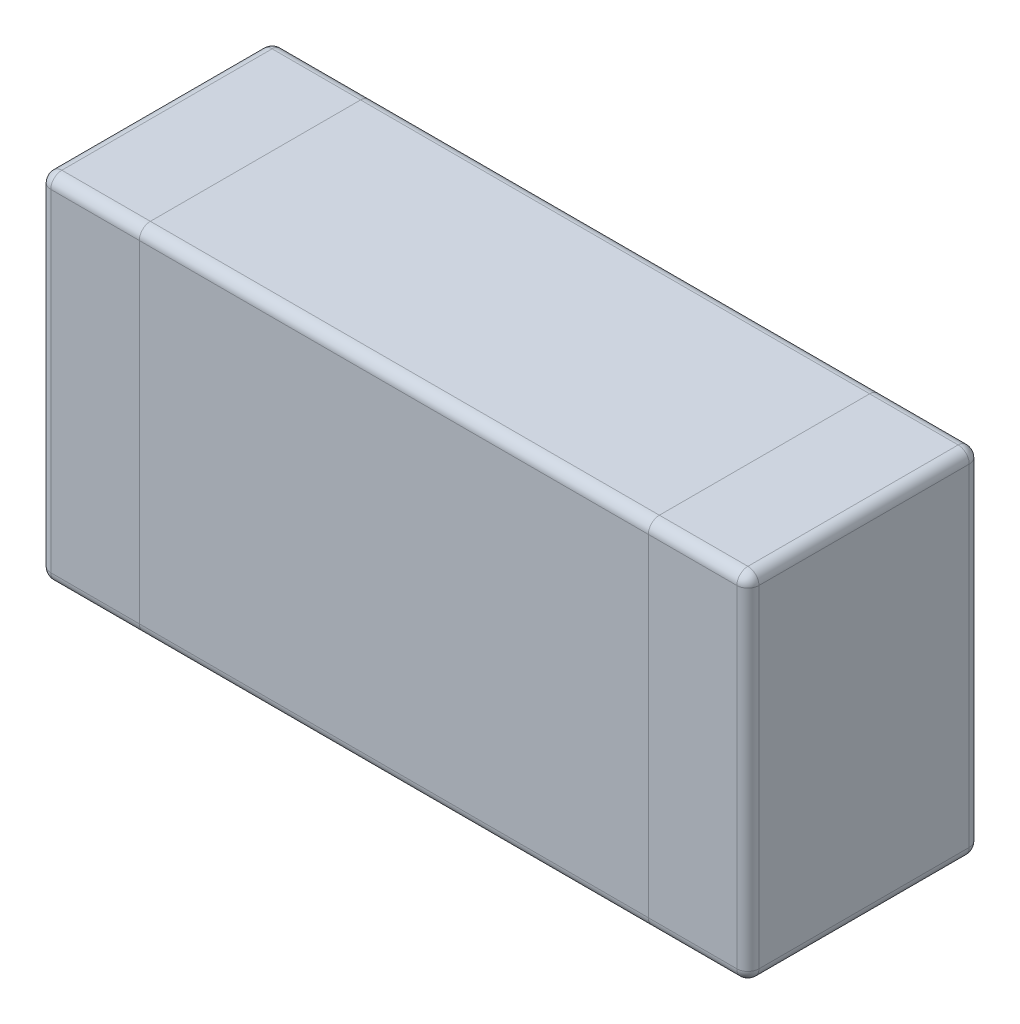
ISO-10303-21;
HEADER;
FILE_DESCRIPTION(('STEP AP214'),'2;1');
FILE_NAME('part.step','',(''),(''),'','','');
FILE_SCHEMA(('AUTOMOTIVE_DESIGN { 1 0 10303 214 1 1 1 1 }'));
ENDSEC;
DATA;
#1=APPLICATION_CONTEXT('core data for automotive mechanical design processes');
#2=APPLICATION_PROTOCOL_DEFINITION('international standard','automotive_design',2000,#1);
#3=PRODUCT_CONTEXT('',#1,'mechanical');
#4=PRODUCT('Part','Part','',(#3));
#5=PRODUCT_RELATED_PRODUCT_CATEGORY('part','',(#4));
#6=PRODUCT_DEFINITION_FORMATION('','',#4);
#7=PRODUCT_DEFINITION_CONTEXT('part definition',#1,'design');
#8=PRODUCT_DEFINITION('design','',#6,#7);
#9=PRODUCT_DEFINITION_SHAPE('','',#8);
#10=(LENGTH_UNIT() NAMED_UNIT(*) SI_UNIT(.MILLI.,.METRE.));
#11=(NAMED_UNIT(*) PLANE_ANGLE_UNIT() SI_UNIT($,.RADIAN.));
#12=(NAMED_UNIT(*) SI_UNIT($,.STERADIAN.) SOLID_ANGLE_UNIT());
#13=UNCERTAINTY_MEASURE_WITH_UNIT(LENGTH_MEASURE(1.E-05),#10,'distance_accuracy_value','');
#14=(GEOMETRIC_REPRESENTATION_CONTEXT(3) GLOBAL_UNCERTAINTY_ASSIGNED_CONTEXT((#13)) GLOBAL_UNIT_ASSIGNED_CONTEXT((#10,
#11,#12)) REPRESENTATION_CONTEXT('',''));
#15=CARTESIAN_POINT('',(0.,0.,0.));
#16=DIRECTION('',(0.,0.,1.));
#17=DIRECTION('',(1.,0.,0.));
#18=AXIS2_PLACEMENT_3D('',#15,#16,#17);
#19=CARTESIAN_POINT('',(1.55,0.749999999999718,1.0500000000002));
#20=DIRECTION('',(0.,2.68882138776405E-13,-1.));
#21=DIRECTION('',(0.,1.,2.68882138776405E-13));
#22=AXIS2_PLACEMENT_3D('',#19,#20,#21);
#23=CYLINDRICAL_SURFACE('',#22,0.05);
#24=CARTESIAN_POINT('',(1.55,0.749999999999731,1.0000000000002));
#25=DIRECTION('',(0.,2.68882138776405E-13,-1.));
#26=DIRECTION('',(0.,-1.,-2.68882138776405E-13));
#27=AXIS2_PLACEMENT_3D('',#24,#25,#26);
#28=CIRCLE('',#27,0.05);
#29=CARTESIAN_POINT('',(1.55,0.799999999999731,1.00000000000021));
#30=VERTEX_POINT('',#29);
#31=CARTESIAN_POINT('',(1.6,0.749999999999731,1.0000000000002));
#32=VERTEX_POINT('',#31);
#33=EDGE_CURVE('E25',#30,#32,#28,.T.);
#34=ORIENTED_EDGE('',*,*,#33,.T.);
#35=DIRECTION('',(0.,-2.68736422004423E-13,1.));
#36=VECTOR('',#35,1.);
#37=CARTESIAN_POINT('',(1.6,0.749999999999718,1.0500000000002));
#38=LINE('',#37,#36);
#39=CARTESIAN_POINT('',(1.6,0.749999999999987,0.0500000000002015));
#40=VERTEX_POINT('',#39);
#41=EDGE_CURVE('E426',#40,#32,#38,.T.);
#42=ORIENTED_EDGE('',*,*,#41,.F.);
#43=CARTESIAN_POINT('',(1.55,0.749999999999987,0.0500000000002015));
#44=DIRECTION('',(0.,-2.68746613504845E-13,1.));
#45=DIRECTION('',(0.,1.,2.68746613504845E-13));
#46=AXIS2_PLACEMENT_3D('',#43,#44,#45);
#47=CIRCLE('',#46,0.05);
#48=CARTESIAN_POINT('',(1.55,0.799999999999987,0.0500000000002149));
#49=VERTEX_POINT('',#48);
#50=EDGE_CURVE('E11',#40,#49,#47,.T.);
#51=ORIENTED_EDGE('',*,*,#50,.T.);
#52=DIRECTION('',(0.,2.68736422004423E-13,-1.));
#53=VECTOR('',#52,1.);
#54=CARTESIAN_POINT('',(1.55,0.799999999999718,1.05000000000021));
#55=LINE('',#54,#53);
#56=EDGE_CURVE('E436',#30,#49,#55,.T.);
#57=ORIENTED_EDGE('',*,*,#56,.F.);
#58=EDGE_LOOP('',(#34,#42,#51,#57));
#59=FACE_BOUND('',#58,.T.);
#60=ADVANCED_FACE('F17',(#59),#23,.T.);
#61=CARTESIAN_POINT('',(1.55,0.749999999999987,0.0500000000002016));
#62=DIRECTION('',(0.,-2.68736422004423E-13,1.));
#63=DIRECTION('',(1.,0.,0.));
#64=AXIS2_PLACEMENT_3D('',#61,#62,#63);
#65=SPHERICAL_SURFACE('',#64,0.05);
#66=CARTESIAN_POINT('',(1.55,0.749999999999987,0.0500000000002015));
#67=DIRECTION('',(0.,1.,2.68736422004423E-13));
#68=DIRECTION('',(-1.,0.,0.));
#69=AXIS2_PLACEMENT_3D('',#66,#67,#68);
#70=CIRCLE('',#69,0.05);
#71=CARTESIAN_POINT('',(1.55,0.75,2.01552316503317E-13));
#72=VERTEX_POINT('',#71);
#73=EDGE_CURVE('E403',#40,#72,#70,.T.);
#74=ORIENTED_EDGE('',*,*,#73,.T.);
#75=CARTESIAN_POINT('',(1.55,0.749999999999987,0.0500000000002016));
#76=DIRECTION('',(1.,0.,0.));
#77=DIRECTION('',(0.,1.,2.68746613504845E-13));
#78=AXIS2_PLACEMENT_3D('',#75,#76,#77);
#79=CIRCLE('',#78,0.05);
#80=EDGE_CURVE('E268',#72,#49,#79,.T.);
#81=ORIENTED_EDGE('',*,*,#80,.T.);
#82=ORIENTED_EDGE('',*,*,#50,.F.);
#83=EDGE_LOOP('',(#74,#81,#82));
#84=FACE_BOUND('',#83,.T.);
#85=ADVANCED_FACE('F555',(#84),#65,.T.);
#86=CARTESIAN_POINT('',(1.55,0.749999999999731,1.0000000000002));
#87=DIRECTION('',(0.,-2.68736422004423E-13,1.));
#88=DIRECTION('',(1.,0.,0.));
#89=AXIS2_PLACEMENT_3D('',#86,#87,#88);
#90=SPHERICAL_SURFACE('',#89,0.05);
#91=CARTESIAN_POINT('',(1.55,0.749999999999731,1.0000000000002));
#92=DIRECTION('',(1.,0.,0.));
#93=DIRECTION('',(0.,-2.68882138776406E-13,1.));
#94=AXIS2_PLACEMENT_3D('',#91,#92,#93);
#95=CIRCLE('',#94,0.05);
#96=CARTESIAN_POINT('',(1.55,0.749999999999718,1.0500000000002));
#97=VERTEX_POINT('',#96);
#98=EDGE_CURVE('E293',#30,#97,#95,.T.);
#99=ORIENTED_EDGE('',*,*,#98,.T.);
#100=CARTESIAN_POINT('',(1.55,0.749999999999731,1.0000000000002));
#101=DIRECTION('',(0.,1.,2.68736422004423E-13));
#102=DIRECTION('',(-1.,0.,0.));
#103=AXIS2_PLACEMENT_3D('',#100,#101,#102);
#104=CIRCLE('',#103,0.05);
#105=EDGE_CURVE('E405',#97,#32,#104,.T.);
#106=ORIENTED_EDGE('',*,*,#105,.T.);
#107=ORIENTED_EDGE('',*,*,#33,.F.);
#108=EDGE_LOOP('',(#99,#106,#107));
#109=FACE_BOUND('',#108,.T.);
#110=ADVANCED_FACE('F512',(#109),#90,.T.);
#111=CARTESIAN_POINT('',(1.55,-0.800000000000014,0.0499999999997849));
#112=DIRECTION('',(0.,-1.,-2.68736422004423E-13));
#113=DIRECTION('',(1.,0.,0.));
#114=AXIS2_PLACEMENT_3D('',#111,#112,#113);
#115=CYLINDRICAL_SURFACE('',#114,0.05);
#116=CARTESIAN_POINT('',(1.55,-0.750000000000014,0.0499999999997985));
#117=DIRECTION('',(0.,1.,2.68736422004423E-13));
#118=DIRECTION('',(1.,0.,0.));
#119=AXIS2_PLACEMENT_3D('',#116,#117,#118);
#120=CIRCLE('',#119,0.05);
#121=CARTESIAN_POINT('',(1.6,-0.750000000000014,0.0499999999997984));
#122=VERTEX_POINT('',#121);
#123=CARTESIAN_POINT('',(1.55,-0.75,-2.01552316503317E-13));
#124=VERTEX_POINT('',#123);
#125=EDGE_CURVE('E504',#122,#124,#120,.T.);
#126=ORIENTED_EDGE('',*,*,#125,.T.);
#127=DIRECTION('',(0.,-1.,-2.68736422004423E-13));
#128=VECTOR('',#127,1.);
#129=CARTESIAN_POINT('',(1.55,-0.8,-2.14989137603538E-13));
#130=LINE('',#129,#128);
#131=EDGE_CURVE('E226',#72,#124,#130,.T.);
#132=ORIENTED_EDGE('',*,*,#131,.F.);
#133=ORIENTED_EDGE('',*,*,#73,.F.);
#134=DIRECTION('',(0.,1.,2.68736422004423E-13));
#135=VECTOR('',#134,1.);
#136=CARTESIAN_POINT('',(1.6,0.799999999999987,0.0500000000002149));
#137=LINE('',#136,#135);
#138=EDGE_CURVE('E432',#122,#40,#137,.T.);
#139=ORIENTED_EDGE('',*,*,#138,.F.);
#140=EDGE_LOOP('',(#126,#132,#133,#139));
#141=FACE_BOUND('',#140,.T.);
#142=ADVANCED_FACE('F551',(#141),#115,.T.);
#143=CARTESIAN_POINT('',(-1.6,0.749999999999987,0.0500000000002015));
#144=DIRECTION('',(1.,0.,0.));
#145=DIRECTION('',(0.,1.,2.68746613504845E-13));
#146=AXIS2_PLACEMENT_3D('',#143,#144,#145);
#147=CYLINDRICAL_SURFACE('',#146,0.05);
#148=CARTESIAN_POINT('',(-1.15,0.749999999999987,0.0500000000002015));
#149=DIRECTION('',(-1.,0.,0.));
#150=DIRECTION('',(0.,1.,2.68746613504845E-13));
#151=AXIS2_PLACEMENT_3D('',#148,#149,#150);
#152=CIRCLE('',#151,0.05);
#153=CARTESIAN_POINT('',(-1.15,0.799999999999987,0.0500000000002149));
#154=VERTEX_POINT('',#153);
#155=CARTESIAN_POINT('',(-1.15,0.75,2.01552316503317E-13));
#156=VERTEX_POINT('',#155);
#157=EDGE_CURVE('E316',#154,#156,#152,.T.);
#158=ORIENTED_EDGE('',*,*,#157,.F.);
#159=DIRECTION('',(-1.,0.,0.));
#160=VECTOR('',#159,1.);
#161=CARTESIAN_POINT('',(-1.6,0.799999999999987,0.0500000000002149));
#162=LINE('',#161,#160);
#163=CARTESIAN_POINT('',(1.15,0.799999999999987,0.0500000000002149));
#164=VERTEX_POINT('',#163);
#165=EDGE_CURVE('E429',#164,#154,#162,.T.);
#166=ORIENTED_EDGE('',*,*,#165,.F.);
#167=CARTESIAN_POINT('',(1.15,0.749999999999987,0.0500000000002015));
#168=DIRECTION('',(1.,0.,0.));
#169=DIRECTION('',(0.,-1.,-2.68746613504845E-13));
#170=AXIS2_PLACEMENT_3D('',#167,#168,#169);
#171=CIRCLE('',#170,0.05);
#172=CARTESIAN_POINT('',(1.15,0.75,2.01552316503317E-13));
#173=VERTEX_POINT('',#172);
#174=EDGE_CURVE('E342',#173,#164,#171,.T.);
#175=ORIENTED_EDGE('',*,*,#174,.F.);
#176=DIRECTION('',(1.,0.,0.));
#177=VECTOR('',#176,1.);
#178=CARTESIAN_POINT('',(1.6,0.75,2.01552316503317E-13));
#179=LINE('',#178,#177);
#180=EDGE_CURVE('E477',#156,#173,#179,.T.);
#181=ORIENTED_EDGE('',*,*,#180,.F.);
#182=EDGE_LOOP('',(#158,#166,#175,#181));
#183=FACE_BOUND('',#182,.T.);
#184=ADVANCED_FACE('F562',(#183),#147,.T.);
#185=CARTESIAN_POINT('',(1.6,0.749999999999731,1.0000000000002));
#186=DIRECTION('',(-1.,0.,0.));
#187=DIRECTION('',(0.,-1.,-2.68882138776405E-13));
#188=AXIS2_PLACEMENT_3D('',#185,#186,#187);
#189=CYLINDRICAL_SURFACE('',#188,0.05);
#190=CARTESIAN_POINT('',(-1.15,0.749999999999731,1.0000000000002));
#191=DIRECTION('',(-1.,0.,0.));
#192=DIRECTION('',(0.,1.,2.68882138776405E-13));
#193=AXIS2_PLACEMENT_3D('',#190,#191,#192);
#194=CIRCLE('',#193,0.05);
#195=CARTESIAN_POINT('',(-1.15,0.749999999999718,1.0500000000002));
#196=VERTEX_POINT('',#195);
#197=CARTESIAN_POINT('',(-1.15,0.799999999999731,1.00000000000021));
#198=VERTEX_POINT('',#197);
#199=EDGE_CURVE('E217',#196,#198,#194,.T.);
#200=ORIENTED_EDGE('',*,*,#199,.F.);
#201=DIRECTION('',(-1.,0.,0.));
#202=VECTOR('',#201,1.);
#203=CARTESIAN_POINT('',(1.6,0.749999999999718,1.0500000000002));
#204=LINE('',#203,#202);
#205=CARTESIAN_POINT('',(1.15,0.749999999999718,1.0500000000002));
#206=VERTEX_POINT('',#205);
#207=EDGE_CURVE('E202',#206,#196,#204,.T.);
#208=ORIENTED_EDGE('',*,*,#207,.F.);
#209=CARTESIAN_POINT('',(1.15,0.749999999999731,1.0000000000002));
#210=DIRECTION('',(1.,0.,0.));
#211=DIRECTION('',(0.,-1.,-2.68882138776405E-13));
#212=AXIS2_PLACEMENT_3D('',#209,#210,#211);
#213=CIRCLE('',#212,0.05);
#214=CARTESIAN_POINT('',(1.15,0.799999999999731,1.00000000000021));
#215=VERTEX_POINT('',#214);
#216=EDGE_CURVE('E298',#215,#206,#213,.T.);
#217=ORIENTED_EDGE('',*,*,#216,.F.);
#218=DIRECTION('',(1.,0.,0.));
#219=VECTOR('',#218,1.);
#220=CARTESIAN_POINT('',(-1.6,0.799999999999731,1.00000000000021));
#221=LINE('',#220,#219);
#222=EDGE_CURVE('E220',#198,#215,#221,.T.);
#223=ORIENTED_EDGE('',*,*,#222,.F.);
#224=EDGE_LOOP('',(#200,#208,#217,#223));
#225=FACE_BOUND('',#224,.T.);
#226=ADVANCED_FACE('F219',(#225),#189,.T.);
#227=CARTESIAN_POINT('',(1.55,0.799999999999731,1.00000000000021));
#228=DIRECTION('',(0.,1.,2.68736422004423E-13));
#229=DIRECTION('',(-1.,0.,0.));
#230=AXIS2_PLACEMENT_3D('',#227,#228,#229);
#231=CYLINDRICAL_SURFACE('',#230,0.05);
#232=CARTESIAN_POINT('',(1.55,-0.750000000000269,0.999999999999799));
#233=DIRECTION('',(0.,1.,2.71050543121376E-13));
#234=DIRECTION('',(0.,2.71050543121376E-13,-1.));
#235=AXIS2_PLACEMENT_3D('',#232,#233,#234);
#236=CIRCLE('',#235,0.05);
#237=CARTESIAN_POINT('',(1.55,-0.750000000000283,1.0499999999998));
#238=VERTEX_POINT('',#237);
#239=CARTESIAN_POINT('',(1.6,-0.750000000000269,0.999999999999799));
#240=VERTEX_POINT('',#239);
#241=EDGE_CURVE('E501',#238,#240,#236,.T.);
#242=ORIENTED_EDGE('',*,*,#241,.T.);
#243=DIRECTION('',(0.,-1.,-2.68736422004423E-13));
#244=VECTOR('',#243,1.);
#245=CARTESIAN_POINT('',(1.6,-0.800000000000269,0.999999999999786));
#246=LINE('',#245,#244);
#247=EDGE_CURVE('E421',#32,#240,#246,.T.);
#248=ORIENTED_EDGE('',*,*,#247,.F.);
#249=ORIENTED_EDGE('',*,*,#105,.F.);
#250=DIRECTION('',(0.,1.,2.68736422004423E-13));
#251=VECTOR('',#250,1.);
#252=CARTESIAN_POINT('',(1.55,0.799999999999718,1.05000000000021));
#253=LINE('',#252,#251);
#254=EDGE_CURVE('E277',#238,#97,#253,.T.);
#255=ORIENTED_EDGE('',*,*,#254,.F.);
#256=EDGE_LOOP('',(#242,#248,#249,#255));
#257=FACE_BOUND('',#256,.T.);
#258=ADVANCED_FACE('F518',(#257),#231,.T.);
#259=CARTESIAN_POINT('',(1.55,-0.750000000000014,0.0499999999997985));
#260=DIRECTION('',(0.,-2.68736422004423E-13,1.));
#261=DIRECTION('',(1.,0.,0.));
#262=AXIS2_PLACEMENT_3D('',#259,#260,#261);
#263=SPHERICAL_SURFACE('',#262,0.05);
#264=CARTESIAN_POINT('',(1.55,-0.750000000000014,0.0499999999997984));
#265=DIRECTION('',(0.,2.68746613504845E-13,-1.));
#266=DIRECTION('',(0.,1.,2.68746613504845E-13));
#267=AXIS2_PLACEMENT_3D('',#264,#265,#266);
#268=CIRCLE('',#267,0.05);
#269=CARTESIAN_POINT('',(1.55,-0.800000000000014,0.0499999999997849));
#270=VERTEX_POINT('',#269);
#271=EDGE_CURVE('E292',#122,#270,#268,.T.);
#272=ORIENTED_EDGE('',*,*,#271,.T.);
#273=CARTESIAN_POINT('',(1.55,-0.750000000000014,0.0499999999997984));
#274=DIRECTION('',(1.,0.,0.));
#275=DIRECTION('',(0.,1.,2.68746613504845E-13));
#276=AXIS2_PLACEMENT_3D('',#273,#274,#275);
#277=CIRCLE('',#276,0.05);
#278=EDGE_CURVE('E370',#270,#124,#277,.T.);
#279=ORIENTED_EDGE('',*,*,#278,.T.);
#280=ORIENTED_EDGE('',*,*,#125,.F.);
#281=EDGE_LOOP('',(#272,#279,#280));
#282=FACE_BOUND('',#281,.T.);
#283=ADVANCED_FACE('F1326',(#282),#263,.T.);
#284=CARTESIAN_POINT('',(-1.55,0.749999999999987,0.0500000000002016));
#285=DIRECTION('',(0.,-2.68736422004423E-13,1.));
#286=DIRECTION('',(1.,0.,0.));
#287=AXIS2_PLACEMENT_3D('',#284,#285,#286);
#288=SPHERICAL_SURFACE('',#287,0.05);
#289=CARTESIAN_POINT('',(-1.55,0.749999999999987,0.0500000000002016));
#290=DIRECTION('',(0.,1.,2.68736422004423E-13));
#291=DIRECTION('',(-1.,0.,0.));
#292=AXIS2_PLACEMENT_3D('',#289,#290,#291);
#293=CIRCLE('',#292,0.05);
#294=CARTESIAN_POINT('',(-1.55,0.75,2.01552316503317E-13));
#295=VERTEX_POINT('',#294);
#296=CARTESIAN_POINT('',(-1.6,0.749999999999987,0.0500000000002015));
#297=VERTEX_POINT('',#296);
#298=EDGE_CURVE('E38',#295,#297,#293,.T.);
#299=ORIENTED_EDGE('',*,*,#298,.T.);
#300=CARTESIAN_POINT('',(-1.55,0.749999999999987,0.0500000000002015));
#301=DIRECTION('',(0.,2.68746613504845E-13,-1.));
#302=DIRECTION('',(0.,1.,2.68746613504845E-13));
#303=AXIS2_PLACEMENT_3D('',#300,#301,#302);
#304=CIRCLE('',#303,0.05);
#305=CARTESIAN_POINT('',(-1.55,0.799999999999987,0.0500000000002149));
#306=VERTEX_POINT('',#305);
#307=EDGE_CURVE('E480',#297,#306,#304,.T.);
#308=ORIENTED_EDGE('',*,*,#307,.T.);
#309=CARTESIAN_POINT('',(-1.55,0.749999999999987,0.0500000000002015));
#310=DIRECTION('',(1.,0.,0.));
#311=DIRECTION('',(0.,-1.,-2.68746613504845E-13));
#312=AXIS2_PLACEMENT_3D('',#309,#310,#311);
#313=CIRCLE('',#312,0.05);
#314=EDGE_CURVE('E320',#295,#306,#313,.T.);
#315=ORIENTED_EDGE('',*,*,#314,.F.);
#316=EDGE_LOOP('',(#299,#308,#315));
#317=FACE_BOUND('',#316,.T.);
#318=ADVANCED_FACE('F1140',(#317),#288,.T.);
#319=CARTESIAN_POINT('',(-1.55,0.749999999999731,1.0000000000002));
#320=DIRECTION('',(0.,-2.68736422004423E-13,1.));
#321=DIRECTION('',(1.,0.,0.));
#322=AXIS2_PLACEMENT_3D('',#319,#320,#321);
#323=SPHERICAL_SURFACE('',#322,0.05);
#324=CARTESIAN_POINT('',(-1.55,0.749999999999731,1.0000000000002));
#325=DIRECTION('',(0.,-2.68882138776405E-13,1.));
#326=DIRECTION('',(0.,-1.,-2.68882138776405E-13));
#327=AXIS2_PLACEMENT_3D('',#324,#325,#326);
#328=CIRCLE('',#327,0.05);
#329=CARTESIAN_POINT('',(-1.55,0.799999999999731,1.00000000000021));
#330=VERTEX_POINT('',#329);
#331=CARTESIAN_POINT('',(-1.6,0.749999999999732,1.0000000000002));
#332=VERTEX_POINT('',#331);
#333=EDGE_CURVE('E49',#330,#332,#328,.T.);
#334=ORIENTED_EDGE('',*,*,#333,.T.);
#335=CARTESIAN_POINT('',(-1.55,0.749999999999732,1.0000000000002));
#336=DIRECTION('',(0.,1.,2.71050543121376E-13));
#337=DIRECTION('',(0.,-2.71050543121376E-13,1.));
#338=AXIS2_PLACEMENT_3D('',#335,#336,#337);
#339=CIRCLE('',#338,0.05);
#340=CARTESIAN_POINT('',(-1.55,0.749999999999718,1.0500000000002));
#341=VERTEX_POINT('',#340);
#342=EDGE_CURVE('E459',#332,#341,#339,.T.);
#343=ORIENTED_EDGE('',*,*,#342,.T.);
#344=CARTESIAN_POINT('',(-1.55,0.749999999999731,1.0000000000002));
#345=DIRECTION('',(1.,0.,0.));
#346=DIRECTION('',(0.,-1.,-2.68882138776405E-13));
#347=AXIS2_PLACEMENT_3D('',#344,#345,#346);
#348=CIRCLE('',#347,0.05);
#349=EDGE_CURVE('E232',#330,#341,#348,.T.);
#350=ORIENTED_EDGE('',*,*,#349,.F.);
#351=EDGE_LOOP('',(#334,#343,#350));
#352=FACE_BOUND('',#351,.T.);
#353=ADVANCED_FACE('F570',(#352),#323,.T.);
#354=CARTESIAN_POINT('',(1.55,-0.750000000000269,0.999999999999799));
#355=DIRECTION('',(0.,-2.68736422004423E-13,1.));
#356=DIRECTION('',(1.,0.,0.));
#357=AXIS2_PLACEMENT_3D('',#354,#355,#356);
#358=SPHERICAL_SURFACE('',#357,0.05);
#359=CARTESIAN_POINT('',(1.55,-0.750000000000269,0.999999999999799));
#360=DIRECTION('',(1.,0.,0.));
#361=DIRECTION('',(0.,1.,2.68882138776405E-13));
#362=AXIS2_PLACEMENT_3D('',#359,#360,#361);
#363=CIRCLE('',#362,0.05);
#364=CARTESIAN_POINT('',(1.55,-0.800000000000269,0.999999999999786));
#365=VERTEX_POINT('',#364);
#366=EDGE_CURVE('E309',#238,#365,#363,.T.);
#367=ORIENTED_EDGE('',*,*,#366,.T.);
#368=CARTESIAN_POINT('',(1.55,-0.750000000000269,0.999999999999799));
#369=DIRECTION('',(0.,-2.68882138776405E-13,1.));
#370=DIRECTION('',(0.,-1.,-2.68882138776405E-13));
#371=AXIS2_PLACEMENT_3D('',#368,#369,#370);
#372=CIRCLE('',#371,0.05);
#373=EDGE_CURVE('E288',#365,#240,#372,.T.);
#374=ORIENTED_EDGE('',*,*,#373,.T.);
#375=ORIENTED_EDGE('',*,*,#241,.F.);
#376=EDGE_LOOP('',(#367,#374,#375));
#377=FACE_BOUND('',#376,.T.);
#378=ADVANCED_FACE('F541',(#377),#358,.T.);
#379=CARTESIAN_POINT('',(1.55,-0.750000000000283,1.0499999999998));
#380=DIRECTION('',(0.,2.68882138776405E-13,-1.));
#381=DIRECTION('',(0.,1.,2.68882138776405E-13));
#382=AXIS2_PLACEMENT_3D('',#379,#380,#381);
#383=CYLINDRICAL_SURFACE('',#382,0.05);
#384=ORIENTED_EDGE('',*,*,#373,.F.);
#385=DIRECTION('',(0.,-2.68736422004423E-13,1.));
#386=VECTOR('',#385,1.);
#387=CARTESIAN_POINT('',(1.55,-0.800000000000282,1.04999999999979));
#388=LINE('',#387,#386);
#389=EDGE_CURVE('E346',#270,#365,#388,.T.);
#390=ORIENTED_EDGE('',*,*,#389,.F.);
#391=ORIENTED_EDGE('',*,*,#271,.F.);
#392=DIRECTION('',(0.,2.68736422004423E-13,-1.));
#393=VECTOR('',#392,1.);
#394=CARTESIAN_POINT('',(1.6,-0.750000000000283,1.0499999999998));
#395=LINE('',#394,#393);
#396=EDGE_CURVE('E425',#240,#122,#395,.T.);
#397=ORIENTED_EDGE('',*,*,#396,.F.);
#398=EDGE_LOOP('',(#384,#390,#391,#397));
#399=FACE_BOUND('',#398,.T.);
#400=ADVANCED_FACE('F546',(#399),#383,.T.);
#401=CARTESIAN_POINT('',(-1.6,-0.750000000000014,0.0499999999997984));
#402=DIRECTION('',(-1.,0.,0.));
#403=DIRECTION('',(0.,-1.,-2.68746613504845E-13));
#404=AXIS2_PLACEMENT_3D('',#401,#402,#403);
#405=CYLINDRICAL_SURFACE('',#404,0.05);
#406=CARTESIAN_POINT('',(-1.15,-0.750000000000014,0.0499999999997984));
#407=DIRECTION('',(-1.,0.,0.));
#408=DIRECTION('',(0.,1.,2.68746613504845E-13));
#409=AXIS2_PLACEMENT_3D('',#406,#407,#408);
#410=CIRCLE('',#409,0.05);
#411=CARTESIAN_POINT('',(-1.15,-0.75,-2.01552316503317E-13));
#412=VERTEX_POINT('',#411);
#413=CARTESIAN_POINT('',(-1.15,-0.800000000000014,0.0499999999997849));
#414=VERTEX_POINT('',#413);
#415=EDGE_CURVE('E354',#412,#414,#410,.T.);
#416=ORIENTED_EDGE('',*,*,#415,.F.);
#417=DIRECTION('',(-1.,0.,0.));
#418=VECTOR('',#417,1.);
#419=CARTESIAN_POINT('',(-1.6,-0.75,-2.01552316503317E-13));
#420=LINE('',#419,#418);
#421=CARTESIAN_POINT('',(1.15,-0.75,-2.01552316503317E-13));
#422=VERTEX_POINT('',#421);
#423=EDGE_CURVE('E483',#422,#412,#420,.T.);
#424=ORIENTED_EDGE('',*,*,#423,.F.);
#425=CARTESIAN_POINT('',(1.15,-0.750000000000014,0.0499999999997984));
#426=DIRECTION('',(1.,0.,0.));
#427=DIRECTION('',(0.,-1.,-2.68746613504845E-13));
#428=AXIS2_PLACEMENT_3D('',#425,#426,#427);
#429=CIRCLE('',#428,0.05);
#430=CARTESIAN_POINT('',(1.15,-0.800000000000014,0.0499999999997849));
#431=VERTEX_POINT('',#430);
#432=EDGE_CURVE('E362',#431,#422,#429,.T.);
#433=ORIENTED_EDGE('',*,*,#432,.F.);
#434=DIRECTION('',(1.,0.,0.));
#435=VECTOR('',#434,1.);
#436=CARTESIAN_POINT('',(1.6,-0.800000000000014,0.0499999999997849));
#437=LINE('',#436,#435);
#438=EDGE_CURVE('E214',#414,#431,#437,.T.);
#439=ORIENTED_EDGE('',*,*,#438,.F.);
#440=EDGE_LOOP('',(#416,#424,#433,#439));
#441=FACE_BOUND('',#440,.T.);
#442=ADVANCED_FACE('F1039',(#441),#405,.T.);
#443=CARTESIAN_POINT('',(-1.55,-0.800000000000014,0.0499999999997849));
#444=DIRECTION('',(0.,1.,2.68736422004423E-13));
#445=DIRECTION('',(-1.,0.,0.));
#446=AXIS2_PLACEMENT_3D('',#443,#444,#445);
#447=CYLINDRICAL_SURFACE('',#446,0.05);
#448=CARTESIAN_POINT('',(-1.55,-0.750000000000014,0.0499999999997984));
#449=DIRECTION('',(0.,1.,2.68736422004423E-13));
#450=DIRECTION('',(1.,0.,0.));
#451=AXIS2_PLACEMENT_3D('',#448,#449,#450);
#452=CIRCLE('',#451,0.05);
#453=CARTESIAN_POINT('',(-1.55,-0.75,-2.01552316503317E-13));
#454=VERTEX_POINT('',#453);
#455=CARTESIAN_POINT('',(-1.6,-0.750000000000014,0.0499999999997984));
#456=VERTEX_POINT('',#455);
#457=EDGE_CURVE('E456',#454,#456,#452,.T.);
#458=ORIENTED_EDGE('',*,*,#457,.T.);
#459=DIRECTION('',(0.,-1.,-2.68736422004423E-13));
#460=VECTOR('',#459,1.);
#461=CARTESIAN_POINT('',(-1.6,-0.800000000000014,0.0499999999997849));
#462=LINE('',#461,#460);
#463=EDGE_CURVE('E396',#297,#456,#462,.T.);
#464=ORIENTED_EDGE('',*,*,#463,.F.);
#465=ORIENTED_EDGE('',*,*,#298,.F.);
#466=DIRECTION('',(0.,1.,2.68736422004423E-13));
#467=VECTOR('',#466,1.);
#468=CARTESIAN_POINT('',(-1.55,0.8,2.14989137603538E-13));
#469=LINE('',#468,#467);
#470=EDGE_CURVE('E385',#454,#295,#469,.T.);
#471=ORIENTED_EDGE('',*,*,#470,.F.);
#472=EDGE_LOOP('',(#458,#464,#465,#471));
#473=FACE_BOUND('',#472,.T.);
#474=ADVANCED_FACE('F1290',(#473),#447,.T.);
#475=CARTESIAN_POINT('',(-1.55,0.749999999999718,1.0500000000002));
#476=DIRECTION('',(0.,2.68882138776405E-13,-1.));
#477=DIRECTION('',(0.,1.,2.68882138776405E-13));
#478=AXIS2_PLACEMENT_3D('',#475,#476,#477);
#479=CYLINDRICAL_SURFACE('',#478,0.05);
#480=ORIENTED_EDGE('',*,*,#307,.F.);
#481=DIRECTION('',(0.,2.68736422004423E-13,-1.));
#482=VECTOR('',#481,1.);
#483=CARTESIAN_POINT('',(-1.6,0.749999999999718,1.0500000000002));
#484=LINE('',#483,#482);
#485=EDGE_CURVE('E440',#332,#297,#484,.T.);
#486=ORIENTED_EDGE('',*,*,#485,.F.);
#487=ORIENTED_EDGE('',*,*,#333,.F.);
#488=DIRECTION('',(0.,-2.68736422004423E-13,1.));
#489=VECTOR('',#488,1.);
#490=CARTESIAN_POINT('',(-1.55,0.799999999999718,1.05000000000021));
#491=LINE('',#490,#489);
#492=EDGE_CURVE('E251',#306,#330,#491,.T.);
#493=ORIENTED_EDGE('',*,*,#492,.F.);
#494=EDGE_LOOP('',(#480,#486,#487,#493));
#495=FACE_BOUND('',#494,.T.);
#496=ADVANCED_FACE('F575',(#495),#479,.T.);
#497=CARTESIAN_POINT('',(-1.55,0.799999999999731,1.00000000000021));
#498=DIRECTION('',(0.,-1.,-2.68736422004423E-13));
#499=DIRECTION('',(1.,0.,0.));
#500=AXIS2_PLACEMENT_3D('',#497,#498,#499);
#501=CYLINDRICAL_SURFACE('',#500,0.05);
#502=CARTESIAN_POINT('',(-1.55,-0.750000000000269,0.999999999999799));
#503=DIRECTION('',(0.,1.,2.68736422004423E-13));
#504=DIRECTION('',(1.,0.,0.));
#505=AXIS2_PLACEMENT_3D('',#502,#503,#504);
#506=CIRCLE('',#505,0.05);
#507=CARTESIAN_POINT('',(-1.6,-0.750000000000269,0.999999999999799));
#508=VERTEX_POINT('',#507);
#509=CARTESIAN_POINT('',(-1.55,-0.750000000000283,1.0499999999998));
#510=VERTEX_POINT('',#509);
#511=EDGE_CURVE('E460',#508,#510,#506,.T.);
#512=ORIENTED_EDGE('',*,*,#511,.T.);
#513=DIRECTION('',(0.,-1.,-2.68736422004423E-13));
#514=VECTOR('',#513,1.);
#515=CARTESIAN_POINT('',(-1.55,0.799999999999718,1.05000000000021));
#516=LINE('',#515,#514);
#517=EDGE_CURVE('E237',#341,#510,#516,.T.);
#518=ORIENTED_EDGE('',*,*,#517,.F.);
#519=ORIENTED_EDGE('',*,*,#342,.F.);
#520=DIRECTION('',(0.,1.,2.68736422004423E-13));
#521=VECTOR('',#520,1.);
#522=CARTESIAN_POINT('',(-1.6,-0.800000000000269,0.999999999999786));
#523=LINE('',#522,#521);
#524=EDGE_CURVE('E464',#508,#332,#523,.T.);
#525=ORIENTED_EDGE('',*,*,#524,.F.);
#526=EDGE_LOOP('',(#512,#518,#519,#525));
#527=FACE_BOUND('',#526,.T.);
#528=ADVANCED_FACE('F574',(#527),#501,.T.);
#529=CARTESIAN_POINT('',(1.6,-0.750000000000269,0.999999999999799));
#530=DIRECTION('',(1.,0.,0.));
#531=DIRECTION('',(0.,1.,2.68882138776405E-13));
#532=AXIS2_PLACEMENT_3D('',#529,#530,#531);
#533=CYLINDRICAL_SURFACE('',#532,0.05);
#534=CARTESIAN_POINT('',(-1.15,-0.750000000000269,0.999999999999799));
#535=DIRECTION('',(-1.,0.,0.));
#536=DIRECTION('',(0.,1.,2.68882138776405E-13));
#537=AXIS2_PLACEMENT_3D('',#534,#535,#536);
#538=CIRCLE('',#537,0.05);
#539=CARTESIAN_POINT('',(-1.15,-0.800000000000269,0.999999999999786));
#540=VERTEX_POINT('',#539);
#541=CARTESIAN_POINT('',(-1.15,-0.750000000000283,1.0499999999998));
#542=VERTEX_POINT('',#541);
#543=EDGE_CURVE('E287',#540,#542,#538,.T.);
#544=ORIENTED_EDGE('',*,*,#543,.F.);
#545=DIRECTION('',(-1.,0.,0.));
#546=VECTOR('',#545,1.);
#547=CARTESIAN_POINT('',(-1.6,-0.800000000000269,0.999999999999786));
#548=LINE('',#547,#546);
#549=CARTESIAN_POINT('',(1.15,-0.800000000000269,0.999999999999786));
#550=VERTEX_POINT('',#549);
#551=EDGE_CURVE('E264',#550,#540,#548,.T.);
#552=ORIENTED_EDGE('',*,*,#551,.F.);
#553=CARTESIAN_POINT('',(1.15,-0.750000000000269,0.999999999999799));
#554=DIRECTION('',(1.,0.,0.));
#555=DIRECTION('',(0.,-1.,-2.68882138776405E-13));
#556=AXIS2_PLACEMENT_3D('',#553,#554,#555);
#557=CIRCLE('',#556,0.05);
#558=CARTESIAN_POINT('',(1.15,-0.750000000000283,1.0499999999998));
#559=VERTEX_POINT('',#558);
#560=EDGE_CURVE('E286',#559,#550,#557,.T.);
#561=ORIENTED_EDGE('',*,*,#560,.F.);
#562=DIRECTION('',(1.,0.,0.));
#563=VECTOR('',#562,1.);
#564=CARTESIAN_POINT('',(1.6,-0.750000000000283,1.0499999999998));
#565=LINE('',#564,#563);
#566=EDGE_CURVE('E213',#542,#559,#565,.T.);
#567=ORIENTED_EDGE('',*,*,#566,.F.);
#568=EDGE_LOOP('',(#544,#552,#561,#567));
#569=FACE_BOUND('',#568,.T.);
#570=ADVANCED_FACE('F1260',(#569),#533,.T.);
#571=CARTESIAN_POINT('',(-1.55,-0.750000000000014,0.0499999999997985));
#572=DIRECTION('',(0.,-2.68736422004423E-13,1.));
#573=DIRECTION('',(1.,0.,0.));
#574=AXIS2_PLACEMENT_3D('',#571,#572,#573);
#575=SPHERICAL_SURFACE('',#574,0.05);
#576=CARTESIAN_POINT('',(-1.55,-0.750000000000014,0.0499999999997985));
#577=DIRECTION('',(1.,0.,0.));
#578=DIRECTION('',(0.,-1.,-2.70508442035133E-13));
#579=AXIS2_PLACEMENT_3D('',#576,#577,#578);
#580=CIRCLE('',#579,0.05);
#581=CARTESIAN_POINT('',(-1.55,-0.800000000000014,0.0499999999997849));
#582=VERTEX_POINT('',#581);
#583=EDGE_CURVE('E358',#582,#454,#580,.T.);
#584=ORIENTED_EDGE('',*,*,#583,.F.);
#585=CARTESIAN_POINT('',(-1.55,-0.750000000000014,0.0499999999997984));
#586=DIRECTION('',(0.,2.68746613504845E-13,-1.));
#587=DIRECTION('',(0.,1.,2.68746613504845E-13));
#588=AXIS2_PLACEMENT_3D('',#585,#586,#587);
#589=CIRCLE('',#588,0.05);
#590=EDGE_CURVE('E489',#582,#456,#589,.T.);
#591=ORIENTED_EDGE('',*,*,#590,.T.);
#592=ORIENTED_EDGE('',*,*,#457,.F.);
#593=EDGE_LOOP('',(#584,#591,#592));
#594=FACE_BOUND('',#593,.T.);
#595=ADVANCED_FACE('F1250',(#594),#575,.T.);
#596=CARTESIAN_POINT('',(-1.55,-0.750000000000269,0.999999999999799));
#597=DIRECTION('',(0.,-2.68736422004423E-13,1.));
#598=DIRECTION('',(1.,0.,0.));
#599=AXIS2_PLACEMENT_3D('',#596,#597,#598);
#600=SPHERICAL_SURFACE('',#599,0.05);
#601=ORIENTED_EDGE('',*,*,#511,.F.);
#602=CARTESIAN_POINT('',(-1.55,-0.750000000000269,0.999999999999799));
#603=DIRECTION('',(0.,-2.68882138776405E-13,1.));
#604=DIRECTION('',(0.,-1.,-2.68882138776405E-13));
#605=AXIS2_PLACEMENT_3D('',#602,#603,#604);
#606=CIRCLE('',#605,0.05);
#607=CARTESIAN_POINT('',(-1.55,-0.800000000000269,0.999999999999786));
#608=VERTEX_POINT('',#607);
#609=EDGE_CURVE('E486',#508,#608,#606,.T.);
#610=ORIENTED_EDGE('',*,*,#609,.T.);
#611=CARTESIAN_POINT('',(-1.55,-0.750000000000269,0.999999999999799));
#612=DIRECTION('',(1.,0.,0.));
#613=DIRECTION('',(0.,2.68882138776405E-13,-1.));
#614=AXIS2_PLACEMENT_3D('',#611,#612,#613);
#615=CIRCLE('',#614,0.05);
#616=EDGE_CURVE('E282',#510,#608,#615,.T.);
#617=ORIENTED_EDGE('',*,*,#616,.F.);
#618=EDGE_LOOP('',(#601,#610,#617));
#619=FACE_BOUND('',#618,.T.);
#620=ADVANCED_FACE('F587',(#619),#600,.T.);
#621=CARTESIAN_POINT('',(-1.55,-0.750000000000283,1.0499999999998));
#622=DIRECTION('',(0.,2.68882138776405E-13,-1.));
#623=DIRECTION('',(0.,1.,2.68882138776405E-13));
#624=AXIS2_PLACEMENT_3D('',#621,#622,#623);
#625=CYLINDRICAL_SURFACE('',#624,0.05);
#626=ORIENTED_EDGE('',*,*,#609,.F.);
#627=DIRECTION('',(0.,-2.68736422004423E-13,1.));
#628=VECTOR('',#627,1.);
#629=CARTESIAN_POINT('',(-1.6,-0.750000000000283,1.0499999999998));
#630=LINE('',#629,#628);
#631=EDGE_CURVE('E455',#456,#508,#630,.T.);
#632=ORIENTED_EDGE('',*,*,#631,.F.);
#633=ORIENTED_EDGE('',*,*,#590,.F.);
#634=DIRECTION('',(0.,2.68736422004423E-13,-1.));
#635=VECTOR('',#634,1.);
#636=CARTESIAN_POINT('',(-1.55,-0.800000000000282,1.04999999999979));
#637=LINE('',#636,#635);
#638=EDGE_CURVE('E257',#608,#582,#637,.T.);
#639=ORIENTED_EDGE('',*,*,#638,.F.);
#640=EDGE_LOOP('',(#626,#632,#633,#639));
#641=FACE_BOUND('',#640,.T.);
#642=ADVANCED_FACE('F582',(#641),#625,.T.);
#643=CARTESIAN_POINT('',(1.6,0.8,2.14989137603538E-13));
#644=DIRECTION('',(0.,2.68736422004423E-13,-1.));
#645=DIRECTION('',(-1.,0.,0.));
#646=AXIS2_PLACEMENT_3D('',#643,#644,#645);
#647=PLANE('',#646);
#648=DIRECTION('',(0.,-1.,-2.68736422004423E-13));
#649=VECTOR('',#648,1.);
#650=CARTESIAN_POINT('',(-1.15,0.8,2.14989137603538E-13));
#651=LINE('',#650,#649);
#652=EDGE_CURVE('E378',#156,#412,#651,.T.);
#653=ORIENTED_EDGE('',*,*,#652,.F.);
#654=ORIENTED_EDGE('',*,*,#180,.T.);
#655=DIRECTION('',(0.,1.,2.68736422004423E-13));
#656=VECTOR('',#655,1.);
#657=CARTESIAN_POINT('',(1.15,0.8,2.14989137603538E-13));
#658=LINE('',#657,#656);
#659=EDGE_CURVE('E389',#422,#173,#658,.T.);
#660=ORIENTED_EDGE('',*,*,#659,.F.);
#661=ORIENTED_EDGE('',*,*,#423,.T.);
#662=EDGE_LOOP('',(#653,#654,#660,#661));
#663=FACE_BOUND('',#662,.T.);
#664=ADVANCED_FACE('F983',(#663),#647,.T.);
#665=CARTESIAN_POINT('',(1.6,0.799999999999718,1.05000000000021));
#666=DIRECTION('',(0.,2.68736422004423E-13,-1.));
#667=DIRECTION('',(-1.,0.,0.));
#668=AXIS2_PLACEMENT_3D('',#665,#666,#667);
#669=PLANE('',#668);
#670=ORIENTED_EDGE('',*,*,#207,.T.);
#671=DIRECTION('',(0.,-1.,-2.68736422004423E-13));
#672=VECTOR('',#671,1.);
#673=CARTESIAN_POINT('',(-1.15,0.799999999999718,1.05000000000021));
#674=LINE('',#673,#672);
#675=EDGE_CURVE('E206',#196,#542,#674,.T.);
#676=ORIENTED_EDGE('',*,*,#675,.T.);
#677=ORIENTED_EDGE('',*,*,#566,.T.);
#678=DIRECTION('',(0.,1.,2.68736422004423E-13));
#679=VECTOR('',#678,1.);
#680=CARTESIAN_POINT('',(1.15,0.799999999999718,1.05000000000021));
#681=LINE('',#680,#679);
#682=EDGE_CURVE('E208',#559,#206,#681,.T.);
#683=ORIENTED_EDGE('',*,*,#682,.T.);
#684=EDGE_LOOP('',(#670,#676,#677,#683));
#685=FACE_BOUND('',#684,.T.);
#686=ADVANCED_FACE('F204',(#685),#669,.F.);
#687=CARTESIAN_POINT('',(-1.6,-0.800000000000282,1.04999999999979));
#688=DIRECTION('',(0.,1.,2.68736422004423E-13));
#689=DIRECTION('',(0.,2.68736422004423E-13,-1.));
#690=AXIS2_PLACEMENT_3D('',#687,#688,#689);
#691=PLANE('',#690);
#692=ORIENTED_EDGE('',*,*,#551,.T.);
#693=DIRECTION('',(0.,2.68736422004423E-13,-1.));
#694=VECTOR('',#693,1.);
#695=CARTESIAN_POINT('',(-1.15,-0.800000000000282,1.04999999999979));
#696=LINE('',#695,#694);
#697=EDGE_CURVE('E262',#540,#414,#696,.T.);
#698=ORIENTED_EDGE('',*,*,#697,.T.);
#699=ORIENTED_EDGE('',*,*,#438,.T.);
#700=DIRECTION('',(0.,-2.68736422004423E-13,1.));
#701=VECTOR('',#700,1.);
#702=CARTESIAN_POINT('',(1.15,-0.800000000000282,1.04999999999979));
#703=LINE('',#702,#701);
#704=EDGE_CURVE('E334',#431,#550,#703,.T.);
#705=ORIENTED_EDGE('',*,*,#704,.T.);
#706=EDGE_LOOP('',(#692,#698,#699,#705));
#707=FACE_BOUND('',#706,.T.);
#708=ADVANCED_FACE('F982',(#707),#691,.F.);
#709=CARTESIAN_POINT('',(-1.6,-0.800000000000282,1.04999999999979));
#710=DIRECTION('',(1.,0.,0.));
#711=DIRECTION('',(0.,1.,0.));
#712=AXIS2_PLACEMENT_3D('',#709,#710,#711);
#713=PLANE('',#712);
#714=ORIENTED_EDGE('',*,*,#631,.T.);
#715=ORIENTED_EDGE('',*,*,#524,.T.);
#716=ORIENTED_EDGE('',*,*,#485,.T.);
#717=ORIENTED_EDGE('',*,*,#463,.T.);
#718=EDGE_LOOP('',(#714,#715,#716,#717));
#719=FACE_BOUND('',#718,.T.);
#720=ADVANCED_FACE('F578',(#719),#713,.F.);
#721=CARTESIAN_POINT('',(-1.6,0.799999999999718,1.05000000000021));
#722=DIRECTION('',(0.,-1.,-2.68736422004423E-13));
#723=DIRECTION('',(0.,2.68736422004423E-13,-1.));
#724=AXIS2_PLACEMENT_3D('',#721,#722,#723);
#725=PLANE('',#724);
#726=ORIENTED_EDGE('',*,*,#165,.T.);
#727=DIRECTION('',(0.,-2.68736422004423E-13,1.));
#728=VECTOR('',#727,1.);
#729=CARTESIAN_POINT('',(-1.15,0.799999999999718,1.05000000000021));
#730=LINE('',#729,#728);
#731=EDGE_CURVE('E256',#154,#198,#730,.T.);
#732=ORIENTED_EDGE('',*,*,#731,.T.);
#733=ORIENTED_EDGE('',*,*,#222,.T.);
#734=DIRECTION('',(0.,2.68736422004423E-13,-1.));
#735=VECTOR('',#734,1.);
#736=CARTESIAN_POINT('',(1.15,0.799999999999718,1.05000000000021));
#737=LINE('',#736,#735);
#738=EDGE_CURVE('E255',#215,#164,#737,.T.);
#739=ORIENTED_EDGE('',*,*,#738,.T.);
#740=EDGE_LOOP('',(#726,#732,#733,#739));
#741=FACE_BOUND('',#740,.T.);
#742=ADVANCED_FACE('F565',(#741),#725,.F.);
#743=CARTESIAN_POINT('',(1.6,-0.800000000000282,1.04999999999979));
#744=DIRECTION('',(-1.,0.,0.));
#745=DIRECTION('',(0.,0.,1.));
#746=AXIS2_PLACEMENT_3D('',#743,#744,#745);
#747=PLANE('',#746);
#748=ORIENTED_EDGE('',*,*,#41,.T.);
#749=ORIENTED_EDGE('',*,*,#247,.T.);
#750=ORIENTED_EDGE('',*,*,#396,.T.);
#751=ORIENTED_EDGE('',*,*,#138,.T.);
#752=EDGE_LOOP('',(#748,#749,#750,#751));
#753=FACE_BOUND('',#752,.T.);
#754=ADVANCED_FACE('F521',(#753),#747,.F.);
#755=CARTESIAN_POINT('',(-1.6,0.799999999999718,1.05000000000021));
#756=DIRECTION('',(0.,-1.,-2.68736422004423E-13));
#757=DIRECTION('',(0.,2.68736422004423E-13,-1.));
#758=AXIS2_PLACEMENT_3D('',#755,#756,#757);
#759=PLANE('',#758);
#760=ORIENTED_EDGE('',*,*,#738,.F.);
#761=DIRECTION('',(1.,0.,0.));
#762=VECTOR('',#761,1.);
#763=CARTESIAN_POINT('',(-1.6,0.799999999999731,1.00000000000021));
#764=LINE('',#763,#762);
#765=EDGE_CURVE('E312',#215,#30,#764,.T.);
#766=ORIENTED_EDGE('',*,*,#765,.T.);
#767=ORIENTED_EDGE('',*,*,#56,.T.);
#768=DIRECTION('',(-1.,0.,0.));
#769=VECTOR('',#768,1.);
#770=CARTESIAN_POINT('',(-1.6,0.799999999999987,0.0500000000002149));
#771=LINE('',#770,#769);
#772=EDGE_CURVE('E272',#49,#164,#771,.T.);
#773=ORIENTED_EDGE('',*,*,#772,.T.);
#774=EDGE_LOOP('',(#760,#766,#767,#773));
#775=FACE_BOUND('',#774,.T.);
#776=ADVANCED_FACE('F529',(#775),#759,.F.);
#777=CARTESIAN_POINT('',(-1.6,0.799999999999718,1.05000000000021));
#778=DIRECTION('',(0.,-1.,-2.68736422004423E-13));
#779=DIRECTION('',(0.,2.68736422004423E-13,-1.));
#780=AXIS2_PLACEMENT_3D('',#777,#778,#779);
#781=PLANE('',#780);
#782=ORIENTED_EDGE('',*,*,#731,.F.);
#783=DIRECTION('',(-1.,0.,0.));
#784=VECTOR('',#783,1.);
#785=CARTESIAN_POINT('',(-1.6,0.799999999999987,0.0500000000002149));
#786=LINE('',#785,#784);
#787=EDGE_CURVE('E297',#154,#306,#786,.T.);
#788=ORIENTED_EDGE('',*,*,#787,.T.);
#789=ORIENTED_EDGE('',*,*,#492,.T.);
#790=DIRECTION('',(1.,0.,0.));
#791=VECTOR('',#790,1.);
#792=CARTESIAN_POINT('',(-1.6,0.799999999999731,1.00000000000021));
#793=LINE('',#792,#791);
#794=EDGE_CURVE('E225',#330,#198,#793,.T.);
#795=ORIENTED_EDGE('',*,*,#794,.T.);
#796=EDGE_LOOP('',(#782,#788,#789,#795));
#797=FACE_BOUND('',#796,.T.);
#798=ADVANCED_FACE('F567',(#797),#781,.F.);
#799=CARTESIAN_POINT('',(-1.6,0.749999999999987,0.0500000000002015));
#800=DIRECTION('',(1.,0.,0.));
#801=DIRECTION('',(0.,1.,2.68746613504845E-13));
#802=AXIS2_PLACEMENT_3D('',#799,#800,#801);
#803=CYLINDRICAL_SURFACE('',#802,0.05);
#804=DIRECTION('',(1.,0.,0.));
#805=VECTOR('',#804,1.);
#806=CARTESIAN_POINT('',(1.6,0.75,2.01552316503317E-13));
#807=LINE('',#806,#805);
#808=EDGE_CURVE('E393',#173,#72,#807,.T.);
#809=ORIENTED_EDGE('',*,*,#808,.F.);
#810=ORIENTED_EDGE('',*,*,#174,.T.);
#811=ORIENTED_EDGE('',*,*,#772,.F.);
#812=ORIENTED_EDGE('',*,*,#80,.F.);
#813=EDGE_LOOP('',(#809,#810,#811,#812));
#814=FACE_BOUND('',#813,.T.);
#815=ADVANCED_FACE('F558',(#814),#803,.T.);
#816=CARTESIAN_POINT('',(-1.6,0.749999999999987,0.0500000000002015));
#817=DIRECTION('',(1.,0.,0.));
#818=DIRECTION('',(0.,1.,2.68746613504845E-13));
#819=AXIS2_PLACEMENT_3D('',#816,#817,#818);
#820=CYLINDRICAL_SURFACE('',#819,0.05);
#821=ORIENTED_EDGE('',*,*,#787,.F.);
#822=ORIENTED_EDGE('',*,*,#157,.T.);
#823=DIRECTION('',(1.,0.,0.));
#824=VECTOR('',#823,1.);
#825=CARTESIAN_POINT('',(1.6,0.75,2.01552316503317E-13));
#826=LINE('',#825,#824);
#827=EDGE_CURVE('E374',#295,#156,#826,.T.);
#828=ORIENTED_EDGE('',*,*,#827,.F.);
#829=ORIENTED_EDGE('',*,*,#314,.T.);
#830=EDGE_LOOP('',(#821,#822,#828,#829));
#831=FACE_BOUND('',#830,.T.);
#832=ADVANCED_FACE('F1051',(#831),#820,.T.);
#833=CARTESIAN_POINT('',(1.6,0.749999999999731,1.0000000000002));
#834=DIRECTION('',(-1.,0.,0.));
#835=DIRECTION('',(0.,-1.,-2.68882138776405E-13));
#836=AXIS2_PLACEMENT_3D('',#833,#834,#835);
#837=CYLINDRICAL_SURFACE('',#836,0.05);
#838=ORIENTED_EDGE('',*,*,#765,.F.);
#839=ORIENTED_EDGE('',*,*,#216,.T.);
#840=DIRECTION('',(-1.,0.,0.));
#841=VECTOR('',#840,1.);
#842=CARTESIAN_POINT('',(1.6,0.749999999999718,1.0500000000002));
#843=LINE('',#842,#841);
#844=EDGE_CURVE('E281',#97,#206,#843,.T.);
#845=ORIENTED_EDGE('',*,*,#844,.F.);
#846=ORIENTED_EDGE('',*,*,#98,.F.);
#847=EDGE_LOOP('',(#838,#839,#845,#846));
#848=FACE_BOUND('',#847,.T.);
#849=ADVANCED_FACE('F527',(#848),#837,.T.);
#850=CARTESIAN_POINT('',(1.6,0.749999999999731,1.0000000000002));
#851=DIRECTION('',(-1.,0.,0.));
#852=DIRECTION('',(0.,-1.,-2.68882138776405E-13));
#853=AXIS2_PLACEMENT_3D('',#850,#851,#852);
#854=CYLINDRICAL_SURFACE('',#853,0.05);
#855=DIRECTION('',(-1.,0.,0.));
#856=VECTOR('',#855,1.);
#857=CARTESIAN_POINT('',(1.6,0.749999999999718,1.0500000000002));
#858=LINE('',#857,#856);
#859=EDGE_CURVE('E230',#196,#341,#858,.T.);
#860=ORIENTED_EDGE('',*,*,#859,.F.);
#861=ORIENTED_EDGE('',*,*,#199,.T.);
#862=ORIENTED_EDGE('',*,*,#794,.F.);
#863=ORIENTED_EDGE('',*,*,#349,.T.);
#864=EDGE_LOOP('',(#860,#861,#862,#863));
#865=FACE_BOUND('',#864,.T.);
#866=ADVANCED_FACE('F231',(#865),#854,.T.);
#867=CARTESIAN_POINT('',(1.6,0.8,2.14989137603538E-13));
#868=DIRECTION('',(0.,2.68736422004423E-13,-1.));
#869=DIRECTION('',(-1.,0.,0.));
#870=AXIS2_PLACEMENT_3D('',#867,#868,#869);
#871=PLANE('',#870);
#872=DIRECTION('',(-1.,0.,0.));
#873=VECTOR('',#872,1.);
#874=CARTESIAN_POINT('',(-1.6,-0.75,-2.01552316503317E-13));
#875=LINE('',#874,#873);
#876=EDGE_CURVE('E366',#124,#422,#875,.T.);
#877=ORIENTED_EDGE('',*,*,#876,.T.);
#878=ORIENTED_EDGE('',*,*,#659,.T.);
#879=ORIENTED_EDGE('',*,*,#808,.T.);
#880=ORIENTED_EDGE('',*,*,#131,.T.);
#881=EDGE_LOOP('',(#877,#878,#879,#880));
#882=FACE_BOUND('',#881,.T.);
#883=ADVANCED_FACE('F1110',(#882),#871,.T.);
#884=CARTESIAN_POINT('',(1.6,0.8,2.14989137603538E-13));
#885=DIRECTION('',(0.,2.68736422004423E-13,-1.));
#886=DIRECTION('',(-1.,0.,0.));
#887=AXIS2_PLACEMENT_3D('',#884,#885,#886);
#888=PLANE('',#887);
#889=ORIENTED_EDGE('',*,*,#827,.T.);
#890=ORIENTED_EDGE('',*,*,#652,.T.);
#891=DIRECTION('',(-1.,0.,0.));
#892=VECTOR('',#891,1.);
#893=CARTESIAN_POINT('',(-1.6,-0.75,-2.01552316503317E-13));
#894=LINE('',#893,#892);
#895=EDGE_CURVE('E350',#412,#454,#894,.T.);
#896=ORIENTED_EDGE('',*,*,#895,.T.);
#897=ORIENTED_EDGE('',*,*,#470,.T.);
#898=EDGE_LOOP('',(#889,#890,#896,#897));
#899=FACE_BOUND('',#898,.T.);
#900=ADVANCED_FACE('F1017',(#899),#888,.T.);
#901=CARTESIAN_POINT('',(-1.6,-0.750000000000014,0.0499999999997984));
#902=DIRECTION('',(-1.,0.,0.));
#903=DIRECTION('',(0.,-1.,-2.68746613504845E-13));
#904=AXIS2_PLACEMENT_3D('',#901,#902,#903);
#905=CYLINDRICAL_SURFACE('',#904,0.05);
#906=DIRECTION('',(1.,0.,0.));
#907=VECTOR('',#906,1.);
#908=CARTESIAN_POINT('',(1.6,-0.800000000000014,0.0499999999997849));
#909=LINE('',#908,#907);
#910=EDGE_CURVE('E338',#431,#270,#909,.T.);
#911=ORIENTED_EDGE('',*,*,#910,.F.);
#912=ORIENTED_EDGE('',*,*,#432,.T.);
#913=ORIENTED_EDGE('',*,*,#876,.F.);
#914=ORIENTED_EDGE('',*,*,#278,.F.);
#915=EDGE_LOOP('',(#911,#912,#913,#914));
#916=FACE_BOUND('',#915,.T.);
#917=ADVANCED_FACE('F1011',(#916),#905,.T.);
#918=CARTESIAN_POINT('',(-1.6,-0.750000000000014,0.0499999999997984));
#919=DIRECTION('',(-1.,0.,0.));
#920=DIRECTION('',(0.,-1.,-2.68746613504845E-13));
#921=AXIS2_PLACEMENT_3D('',#918,#919,#920);
#922=CYLINDRICAL_SURFACE('',#921,0.05);
#923=ORIENTED_EDGE('',*,*,#895,.F.);
#924=ORIENTED_EDGE('',*,*,#415,.T.);
#925=DIRECTION('',(1.,0.,0.));
#926=VECTOR('',#925,1.);
#927=CARTESIAN_POINT('',(1.6,-0.800000000000014,0.0499999999997849));
#928=LINE('',#927,#926);
#929=EDGE_CURVE('E261',#582,#414,#928,.T.);
#930=ORIENTED_EDGE('',*,*,#929,.F.);
#931=ORIENTED_EDGE('',*,*,#583,.T.);
#932=EDGE_LOOP('',(#923,#924,#930,#931));
#933=FACE_BOUND('',#932,.T.);
#934=ADVANCED_FACE('F1016',(#933),#922,.T.);
#935=CARTESIAN_POINT('',(-1.6,-0.800000000000282,1.04999999999979));
#936=DIRECTION('',(0.,1.,2.68736422004423E-13));
#937=DIRECTION('',(0.,2.68736422004423E-13,-1.));
#938=AXIS2_PLACEMENT_3D('',#935,#936,#937);
#939=PLANE('',#938);
#940=ORIENTED_EDGE('',*,*,#704,.F.);
#941=ORIENTED_EDGE('',*,*,#910,.T.);
#942=ORIENTED_EDGE('',*,*,#389,.T.);
#943=DIRECTION('',(-1.,0.,0.));
#944=VECTOR('',#943,1.);
#945=CARTESIAN_POINT('',(-1.6,-0.800000000000269,0.999999999999786));
#946=LINE('',#945,#944);
#947=EDGE_CURVE('E324',#365,#550,#946,.T.);
#948=ORIENTED_EDGE('',*,*,#947,.T.);
#949=EDGE_LOOP('',(#940,#941,#942,#948));
#950=FACE_BOUND('',#949,.T.);
#951=ADVANCED_FACE('F1062',(#950),#939,.F.);
#952=CARTESIAN_POINT('',(-1.6,-0.800000000000282,1.04999999999979));
#953=DIRECTION('',(0.,1.,2.68736422004423E-13));
#954=DIRECTION('',(0.,2.68736422004423E-13,-1.));
#955=AXIS2_PLACEMENT_3D('',#952,#953,#954);
#956=PLANE('',#955);
#957=ORIENTED_EDGE('',*,*,#697,.F.);
#958=DIRECTION('',(-1.,0.,0.));
#959=VECTOR('',#958,1.);
#960=CARTESIAN_POINT('',(-1.6,-0.800000000000269,0.999999999999786));
#961=LINE('',#960,#959);
#962=EDGE_CURVE('E302',#540,#608,#961,.T.);
#963=ORIENTED_EDGE('',*,*,#962,.T.);
#964=ORIENTED_EDGE('',*,*,#638,.T.);
#965=ORIENTED_EDGE('',*,*,#929,.T.);
#966=EDGE_LOOP('',(#957,#963,#964,#965));
#967=FACE_BOUND('',#966,.T.);
#968=ADVANCED_FACE('F1082',(#967),#956,.F.);
#969=CARTESIAN_POINT('',(1.6,-0.750000000000269,0.999999999999799));
#970=DIRECTION('',(1.,0.,0.));
#971=DIRECTION('',(0.,1.,2.68882138776405E-13));
#972=AXIS2_PLACEMENT_3D('',#969,#970,#971);
#973=CYLINDRICAL_SURFACE('',#972,0.05);
#974=DIRECTION('',(1.,0.,0.));
#975=VECTOR('',#974,1.);
#976=CARTESIAN_POINT('',(1.6,-0.750000000000283,1.0499999999998));
#977=LINE('',#976,#975);
#978=EDGE_CURVE('E273',#559,#238,#977,.T.);
#979=ORIENTED_EDGE('',*,*,#978,.F.);
#980=ORIENTED_EDGE('',*,*,#560,.T.);
#981=ORIENTED_EDGE('',*,*,#947,.F.);
#982=ORIENTED_EDGE('',*,*,#366,.F.);
#983=EDGE_LOOP('',(#979,#980,#981,#982));
#984=FACE_BOUND('',#983,.T.);
#985=ADVANCED_FACE('F537',(#984),#973,.T.);
#986=CARTESIAN_POINT('',(1.6,-0.750000000000269,0.999999999999799));
#987=DIRECTION('',(1.,0.,0.));
#988=DIRECTION('',(0.,1.,2.68882138776405E-13));
#989=AXIS2_PLACEMENT_3D('',#986,#987,#988);
#990=CYLINDRICAL_SURFACE('',#989,0.05);
#991=ORIENTED_EDGE('',*,*,#962,.F.);
#992=ORIENTED_EDGE('',*,*,#543,.T.);
#993=DIRECTION('',(1.,0.,0.));
#994=VECTOR('',#993,1.);
#995=CARTESIAN_POINT('',(1.6,-0.750000000000283,1.0499999999998));
#996=LINE('',#995,#994);
#997=EDGE_CURVE('E242',#510,#542,#996,.T.);
#998=ORIENTED_EDGE('',*,*,#997,.F.);
#999=ORIENTED_EDGE('',*,*,#616,.T.);
#1000=EDGE_LOOP('',(#991,#992,#998,#999));
#1001=FACE_BOUND('',#1000,.T.);
#1002=ADVANCED_FACE('F590',(#1001),#990,.T.);
#1003=CARTESIAN_POINT('',(1.6,0.799999999999718,1.05000000000021));
#1004=DIRECTION('',(0.,2.68736422004423E-13,-1.));
#1005=DIRECTION('',(-1.,0.,0.));
#1006=AXIS2_PLACEMENT_3D('',#1003,#1004,#1005);
#1007=PLANE('',#1006);
#1008=ORIENTED_EDGE('',*,*,#682,.F.);
#1009=ORIENTED_EDGE('',*,*,#978,.T.);
#1010=ORIENTED_EDGE('',*,*,#254,.T.);
#1011=ORIENTED_EDGE('',*,*,#844,.T.);
#1012=EDGE_LOOP('',(#1008,#1009,#1010,#1011));
#1013=FACE_BOUND('',#1012,.T.);
#1014=ADVANCED_FACE('F533',(#1013),#1007,.F.);
#1015=CARTESIAN_POINT('',(1.6,0.799999999999718,1.05000000000021));
#1016=DIRECTION('',(0.,2.68736422004423E-13,-1.));
#1017=DIRECTION('',(-1.,0.,0.));
#1018=AXIS2_PLACEMENT_3D('',#1015,#1016,#1017);
#1019=PLANE('',#1018);
#1020=ORIENTED_EDGE('',*,*,#675,.F.);
#1021=ORIENTED_EDGE('',*,*,#859,.T.);
#1022=ORIENTED_EDGE('',*,*,#517,.T.);
#1023=ORIENTED_EDGE('',*,*,#997,.T.);
#1024=EDGE_LOOP('',(#1020,#1021,#1022,#1023));
#1025=FACE_BOUND('',#1024,.T.);
#1026=ADVANCED_FACE('F240',(#1025),#1019,.F.);
#1027=CLOSED_SHELL('',(#60,#85,#110,#142,#184,#226,#258,#283,#318,#353,#378,#400,#442,#474,#496,
#528,#570,#595,#620,#642,#664,#686,#708,#720,#742,#754,#776,#798,#815,#832,#849,#866,#883,#900,
#917,#934,#951,#968,#985,#1002,#1014,#1026));
#1028=MANIFOLD_SOLID_BREP('B1',#1027);
#1029=ADVANCED_BREP_SHAPE_REPRESENTATION('',(#18,#1028),#14);
#1030=SHAPE_DEFINITION_REPRESENTATION(#9,#1029);
ENDSEC;
END-ISO-10303-21;
